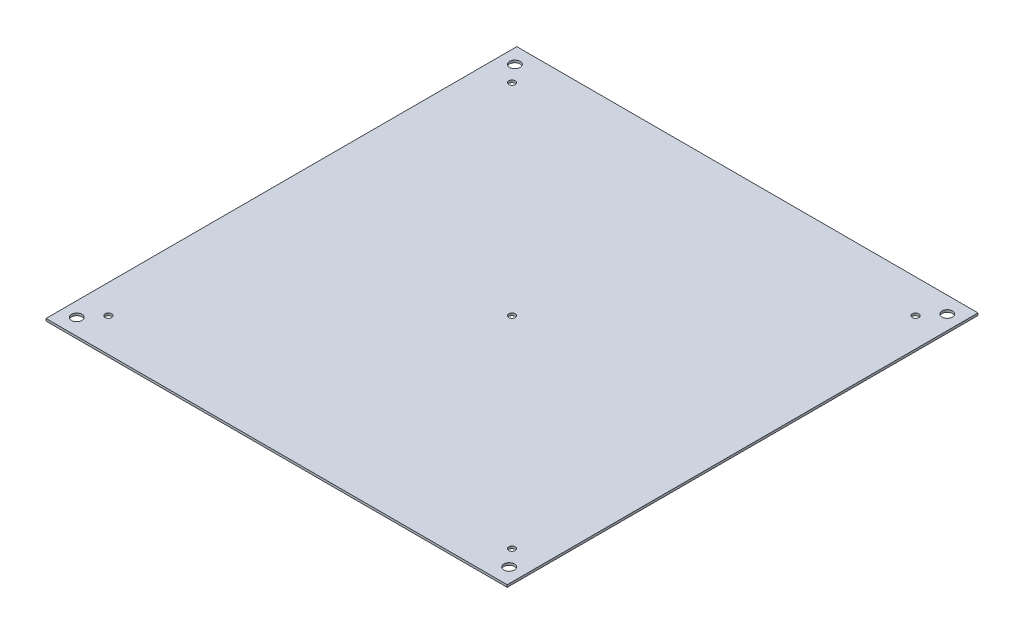
ISO-10303-21;
HEADER;
FILE_DESCRIPTION(('STEP AP214'),'2;1');
FILE_NAME('part.step','',(''),(''),'','','');
FILE_SCHEMA(('AUTOMOTIVE_DESIGN { 1 0 10303 214 1 1 1 1 }'));
ENDSEC;
DATA;
#1=APPLICATION_CONTEXT('core data for automotive mechanical design processes');
#2=APPLICATION_PROTOCOL_DEFINITION('international standard','automotive_design',2000,#1);
#3=PRODUCT_CONTEXT('',#1,'mechanical');
#4=PRODUCT('Part','Part','',(#3));
#5=PRODUCT_RELATED_PRODUCT_CATEGORY('part','',(#4));
#6=PRODUCT_DEFINITION_FORMATION('','',#4);
#7=PRODUCT_DEFINITION_CONTEXT('part definition',#1,'design');
#8=PRODUCT_DEFINITION('design','',#6,#7);
#9=PRODUCT_DEFINITION_SHAPE('','',#8);
#10=(LENGTH_UNIT() NAMED_UNIT(*) SI_UNIT(.MILLI.,.METRE.));
#11=(NAMED_UNIT(*) PLANE_ANGLE_UNIT() SI_UNIT($,.RADIAN.));
#12=(NAMED_UNIT(*) SI_UNIT($,.STERADIAN.) SOLID_ANGLE_UNIT());
#13=UNCERTAINTY_MEASURE_WITH_UNIT(LENGTH_MEASURE(1.E-05),#10,'distance_accuracy_value','');
#14=(GEOMETRIC_REPRESENTATION_CONTEXT(3) GLOBAL_UNCERTAINTY_ASSIGNED_CONTEXT((#13)) GLOBAL_UNIT_ASSIGNED_CONTEXT((#10,
#11,#12)) REPRESENTATION_CONTEXT('',''));
#15=CARTESIAN_POINT('',(0.,0.,0.));
#16=DIRECTION('',(0.,0.,1.));
#17=DIRECTION('',(1.,0.,0.));
#18=AXIS2_PLACEMENT_3D('',#15,#16,#17);
#19=CARTESIAN_POINT('',(-120.,1.2,-122.5));
#20=DIRECTION('',(1.,0.,0.));
#21=DIRECTION('',(0.,0.,-1.));
#22=AXIS2_PLACEMENT_3D('',#19,#20,#21);
#23=PLANE('',#22);
#24=DIRECTION('',(0.,0.,1.));
#25=VECTOR('',#24,1.);
#26=CARTESIAN_POINT('',(-120.,0.,-122.5));
#27=LINE('',#26,#25);
#28=CARTESIAN_POINT('',(-120.,0.,-122.5));
#29=VERTEX_POINT('',#28);
#30=CARTESIAN_POINT('',(-120.,0.,122.5));
#31=VERTEX_POINT('',#30);
#32=EDGE_CURVE('E116',#29,#31,#27,.T.);
#33=ORIENTED_EDGE('',*,*,#32,.T.);
#34=DIRECTION('',(0.,-1.,0.));
#35=VECTOR('',#34,1.);
#36=CARTESIAN_POINT('',(-120.,1.2,122.5));
#37=LINE('',#36,#35);
#38=CARTESIAN_POINT('',(-120.,1.2,122.5));
#39=VERTEX_POINT('',#38);
#40=EDGE_CURVE('E11',#39,#31,#37,.T.);
#41=ORIENTED_EDGE('',*,*,#40,.F.);
#42=DIRECTION('',(0.,0.,1.));
#43=VECTOR('',#42,1.);
#44=CARTESIAN_POINT('',(-120.,1.2,-122.5));
#45=LINE('',#44,#43);
#46=CARTESIAN_POINT('',(-120.,1.2,-122.5));
#47=VERTEX_POINT('',#46);
#48=EDGE_CURVE('E99',#47,#39,#45,.T.);
#49=ORIENTED_EDGE('',*,*,#48,.F.);
#50=DIRECTION('',(0.,-1.,0.));
#51=VECTOR('',#50,1.);
#52=CARTESIAN_POINT('',(-120.,1.2,-122.5));
#53=LINE('',#52,#51);
#54=EDGE_CURVE('E112',#47,#29,#53,.T.);
#55=ORIENTED_EDGE('',*,*,#54,.T.);
#56=EDGE_LOOP('',(#33,#41,#49,#55));
#57=FACE_BOUND('',#56,.T.);
#58=ADVANCED_FACE('F41',(#57),#23,.F.);
#59=CARTESIAN_POINT('',(120.,1.2,122.5));
#60=DIRECTION('',(0.,0.,-1.));
#61=DIRECTION('',(-1.,0.,0.));
#62=AXIS2_PLACEMENT_3D('',#59,#60,#61);
#63=PLANE('',#62);
#64=DIRECTION('',(1.,0.,0.));
#65=VECTOR('',#64,1.);
#66=CARTESIAN_POINT('',(120.,0.,122.5));
#67=LINE('',#66,#65);
#68=CARTESIAN_POINT('',(120.,0.,122.5));
#69=VERTEX_POINT('',#68);
#70=EDGE_CURVE('E104',#31,#69,#67,.T.);
#71=ORIENTED_EDGE('',*,*,#70,.T.);
#72=DIRECTION('',(0.,-1.,0.));
#73=VECTOR('',#72,1.);
#74=CARTESIAN_POINT('',(120.,1.2,122.5));
#75=LINE('',#74,#73);
#76=CARTESIAN_POINT('',(120.,1.2,122.5));
#77=VERTEX_POINT('',#76);
#78=EDGE_CURVE('E50',#77,#69,#75,.T.);
#79=ORIENTED_EDGE('',*,*,#78,.F.);
#80=DIRECTION('',(1.,0.,0.));
#81=VECTOR('',#80,1.);
#82=CARTESIAN_POINT('',(120.,1.2,122.5));
#83=LINE('',#82,#81);
#84=EDGE_CURVE('E94',#39,#77,#83,.T.);
#85=ORIENTED_EDGE('',*,*,#84,.F.);
#86=ORIENTED_EDGE('',*,*,#40,.T.);
#87=EDGE_LOOP('',(#71,#79,#85,#86));
#88=FACE_BOUND('',#87,.T.);
#89=ADVANCED_FACE('F103',(#88),#63,.F.);
#90=CARTESIAN_POINT('',(120.,1.2,-122.5));
#91=DIRECTION('',(-1.,0.,0.));
#92=DIRECTION('',(0.,0.,1.));
#93=AXIS2_PLACEMENT_3D('',#90,#91,#92);
#94=PLANE('',#93);
#95=DIRECTION('',(0.,0.,-1.));
#96=VECTOR('',#95,1.);
#97=CARTESIAN_POINT('',(120.,0.,-122.5));
#98=LINE('',#97,#96);
#99=CARTESIAN_POINT('',(120.,0.,-122.5));
#100=VERTEX_POINT('',#99);
#101=EDGE_CURVE('E80',#69,#100,#98,.T.);
#102=ORIENTED_EDGE('',*,*,#101,.T.);
#103=DIRECTION('',(0.,-1.,0.));
#104=VECTOR('',#103,1.);
#105=CARTESIAN_POINT('',(120.,1.2,-122.5));
#106=LINE('',#105,#104);
#107=CARTESIAN_POINT('',(120.,1.2,-122.5));
#108=VERTEX_POINT('',#107);
#109=EDGE_CURVE('E105',#108,#100,#106,.T.);
#110=ORIENTED_EDGE('',*,*,#109,.F.);
#111=DIRECTION('',(0.,0.,-1.));
#112=VECTOR('',#111,1.);
#113=CARTESIAN_POINT('',(120.,1.2,-122.5));
#114=LINE('',#113,#112);
#115=EDGE_CURVE('E97',#77,#108,#114,.T.);
#116=ORIENTED_EDGE('',*,*,#115,.F.);
#117=ORIENTED_EDGE('',*,*,#78,.T.);
#118=EDGE_LOOP('',(#102,#110,#116,#117));
#119=FACE_BOUND('',#118,.T.);
#120=ADVANCED_FACE('F106',(#119),#94,.F.);
#121=CARTESIAN_POINT('',(120.,1.2,-122.5));
#122=DIRECTION('',(0.,0.,1.));
#123=DIRECTION('',(1.,0.,0.));
#124=AXIS2_PLACEMENT_3D('',#121,#122,#123);
#125=PLANE('',#124);
#126=DIRECTION('',(-1.,0.,0.));
#127=VECTOR('',#126,1.);
#128=CARTESIAN_POINT('',(120.,0.,-122.5));
#129=LINE('',#128,#127);
#130=EDGE_CURVE('E86',#100,#29,#129,.T.);
#131=ORIENTED_EDGE('',*,*,#130,.T.);
#132=ORIENTED_EDGE('',*,*,#54,.F.);
#133=DIRECTION('',(-1.,0.,0.));
#134=VECTOR('',#133,1.);
#135=CARTESIAN_POINT('',(120.,1.2,-122.5));
#136=LINE('',#135,#134);
#137=EDGE_CURVE('E61',#108,#47,#136,.T.);
#138=ORIENTED_EDGE('',*,*,#137,.F.);
#139=ORIENTED_EDGE('',*,*,#109,.T.);
#140=EDGE_LOOP('',(#131,#132,#138,#139));
#141=FACE_BOUND('',#140,.T.);
#142=ADVANCED_FACE('F130',(#141),#125,.F.);
#143=CARTESIAN_POINT('',(0.,1.2,0.));
#144=DIRECTION('',(0.,-1.,0.));
#145=DIRECTION('',(0.,0.,-1.));
#146=AXIS2_PLACEMENT_3D('',#143,#144,#145);
#147=PLANE('',#146);
#148=CARTESIAN_POINT('',(112.5,1.2,114.));
#149=DIRECTION('',(0.,-1.,0.));
#150=DIRECTION('',(0.,0.,-1.));
#151=AXIS2_PLACEMENT_3D('',#148,#149,#150);
#152=CIRCLE('',#151,2.75);
#153=CARTESIAN_POINT('',(112.5,1.2,111.25));
#154=VERTEX_POINT('',#153);
#155=EDGE_CURVE('E198',#154,#154,#152,.T.);
#156=ORIENTED_EDGE('',*,*,#155,.T.);
#157=EDGE_LOOP('',(#156));
#158=FACE_BOUND('',#157,.T.);
#159=CARTESIAN_POINT('',(-112.5,1.2,-114.));
#160=DIRECTION('',(0.,-1.,0.));
#161=DIRECTION('',(0.,0.,-1.));
#162=AXIS2_PLACEMENT_3D('',#159,#160,#161);
#163=CIRCLE('',#162,2.75);
#164=CARTESIAN_POINT('',(-112.5,1.2,-116.75));
#165=VERTEX_POINT('',#164);
#166=EDGE_CURVE('E190',#165,#165,#163,.T.);
#167=ORIENTED_EDGE('',*,*,#166,.T.);
#168=EDGE_LOOP('',(#167));
#169=FACE_BOUND('',#168,.T.);
#170=CARTESIAN_POINT('',(-112.5,1.2,114.));
#171=DIRECTION('',(0.,-1.,0.));
#172=DIRECTION('',(0.,0.,-1.));
#173=AXIS2_PLACEMENT_3D('',#170,#171,#172);
#174=CIRCLE('',#173,2.75);
#175=CARTESIAN_POINT('',(-112.5,1.2,111.25));
#176=VERTEX_POINT('',#175);
#177=EDGE_CURVE('E183',#176,#176,#174,.T.);
#178=ORIENTED_EDGE('',*,*,#177,.T.);
#179=EDGE_LOOP('',(#178));
#180=FACE_BOUND('',#179,.T.);
#181=CARTESIAN_POINT('',(112.5,1.2,-114.));
#182=DIRECTION('',(0.,-1.,0.));
#183=DIRECTION('',(0.,0.,-1.));
#184=AXIS2_PLACEMENT_3D('',#181,#182,#183);
#185=CIRCLE('',#184,2.75);
#186=CARTESIAN_POINT('',(112.5,1.2,-116.75));
#187=VERTEX_POINT('',#186);
#188=EDGE_CURVE('E176',#187,#187,#185,.T.);
#189=ORIENTED_EDGE('',*,*,#188,.T.);
#190=EDGE_LOOP('',(#189));
#191=FACE_BOUND('',#190,.T.);
#192=CARTESIAN_POINT('',(0.,1.2,0.));
#193=DIRECTION('',(0.,1.,0.));
#194=DIRECTION('',(0.,0.,1.));
#195=AXIS2_PLACEMENT_3D('',#192,#193,#194);
#196=CIRCLE('',#195,1.7);
#197=CARTESIAN_POINT('',(0.,1.2,1.7));
#198=VERTEX_POINT('',#197);
#199=EDGE_CURVE('E172',#198,#198,#196,.T.);
#200=ORIENTED_EDGE('',*,*,#199,.F.);
#201=EDGE_LOOP('',(#200));
#202=FACE_BOUND('',#201,.T.);
#203=CARTESIAN_POINT('',(105.,1.2,-105.));
#204=DIRECTION('',(0.,1.,0.));
#205=DIRECTION('',(0.,0.,1.));
#206=AXIS2_PLACEMENT_3D('',#203,#204,#205);
#207=CIRCLE('',#206,1.69999999999999);
#208=CARTESIAN_POINT('',(105.,1.2,-103.3));
#209=VERTEX_POINT('',#208);
#210=EDGE_CURVE('E164',#209,#209,#207,.T.);
#211=ORIENTED_EDGE('',*,*,#210,.F.);
#212=EDGE_LOOP('',(#211));
#213=FACE_BOUND('',#212,.T.);
#214=CARTESIAN_POINT('',(-105.,1.2,105.));
#215=DIRECTION('',(0.,1.,0.));
#216=DIRECTION('',(0.,0.,1.));
#217=AXIS2_PLACEMENT_3D('',#214,#215,#216);
#218=CIRCLE('',#217,1.69999999999999);
#219=CARTESIAN_POINT('',(-105.,1.2,106.7));
#220=VERTEX_POINT('',#219);
#221=EDGE_CURVE('E156',#220,#220,#218,.T.);
#222=ORIENTED_EDGE('',*,*,#221,.F.);
#223=EDGE_LOOP('',(#222));
#224=FACE_BOUND('',#223,.T.);
#225=CARTESIAN_POINT('',(-105.,1.2,-105.));
#226=DIRECTION('',(0.,1.,0.));
#227=DIRECTION('',(0.,0.,1.));
#228=AXIS2_PLACEMENT_3D('',#225,#226,#227);
#229=CIRCLE('',#228,1.69999999999999);
#230=CARTESIAN_POINT('',(-105.,1.2,-103.3));
#231=VERTEX_POINT('',#230);
#232=EDGE_CURVE('E148',#231,#231,#229,.T.);
#233=ORIENTED_EDGE('',*,*,#232,.F.);
#234=EDGE_LOOP('',(#233));
#235=FACE_BOUND('',#234,.T.);
#236=CARTESIAN_POINT('',(105.,1.2,105.));
#237=DIRECTION('',(0.,1.,0.));
#238=DIRECTION('',(0.,0.,1.));
#239=AXIS2_PLACEMENT_3D('',#236,#237,#238);
#240=CIRCLE('',#239,1.69999999999999);
#241=CARTESIAN_POINT('',(105.,1.2,106.7));
#242=VERTEX_POINT('',#241);
#243=EDGE_CURVE('E140',#242,#242,#240,.T.);
#244=ORIENTED_EDGE('',*,*,#243,.F.);
#245=EDGE_LOOP('',(#244));
#246=FACE_BOUND('',#245,.T.);
#247=ORIENTED_EDGE('',*,*,#48,.T.);
#248=ORIENTED_EDGE('',*,*,#84,.T.);
#249=ORIENTED_EDGE('',*,*,#115,.T.);
#250=ORIENTED_EDGE('',*,*,#137,.T.);
#251=EDGE_LOOP('',(#247,#248,#249,#250));
#252=FACE_BOUND('',#251,.T.);
#253=ADVANCED_FACE('F95',(#158,#169,#180,#191,#202,#213,#224,#235,#246,#252),#147,.F.);
#254=CARTESIAN_POINT('',(0.,0.,0.));
#255=DIRECTION('',(0.,-1.,0.));
#256=DIRECTION('',(0.,0.,-1.));
#257=AXIS2_PLACEMENT_3D('',#254,#255,#256);
#258=PLANE('',#257);
#259=CARTESIAN_POINT('',(112.5,0.,114.));
#260=DIRECTION('',(0.,-1.,0.));
#261=DIRECTION('',(0.,0.,-1.));
#262=AXIS2_PLACEMENT_3D('',#259,#260,#261);
#263=CIRCLE('',#262,2.75);
#264=CARTESIAN_POINT('',(112.5,0.,111.25));
#265=VERTEX_POINT('',#264);
#266=EDGE_CURVE('E202',#265,#265,#263,.T.);
#267=ORIENTED_EDGE('',*,*,#266,.F.);
#268=EDGE_LOOP('',(#267));
#269=FACE_BOUND('',#268,.T.);
#270=CARTESIAN_POINT('',(-112.5,0.,-114.));
#271=DIRECTION('',(0.,-1.,0.));
#272=DIRECTION('',(0.,0.,-1.));
#273=AXIS2_PLACEMENT_3D('',#270,#271,#272);
#274=CIRCLE('',#273,2.75);
#275=CARTESIAN_POINT('',(-112.5,0.,-116.75));
#276=VERTEX_POINT('',#275);
#277=EDGE_CURVE('E194',#276,#276,#274,.T.);
#278=ORIENTED_EDGE('',*,*,#277,.F.);
#279=EDGE_LOOP('',(#278));
#280=FACE_BOUND('',#279,.T.);
#281=CARTESIAN_POINT('',(-112.5,0.,114.));
#282=DIRECTION('',(0.,-1.,0.));
#283=DIRECTION('',(0.,0.,-1.));
#284=AXIS2_PLACEMENT_3D('',#281,#282,#283);
#285=CIRCLE('',#284,2.75);
#286=CARTESIAN_POINT('',(-112.5,0.,111.25));
#287=VERTEX_POINT('',#286);
#288=EDGE_CURVE('E186',#287,#287,#285,.T.);
#289=ORIENTED_EDGE('',*,*,#288,.F.);
#290=EDGE_LOOP('',(#289));
#291=FACE_BOUND('',#290,.T.);
#292=CARTESIAN_POINT('',(112.5,0.,-114.));
#293=DIRECTION('',(0.,-1.,0.));
#294=DIRECTION('',(0.,0.,-1.));
#295=AXIS2_PLACEMENT_3D('',#292,#293,#294);
#296=CIRCLE('',#295,2.75);
#297=CARTESIAN_POINT('',(112.5,0.,-116.75));
#298=VERTEX_POINT('',#297);
#299=EDGE_CURVE('E180',#298,#298,#296,.T.);
#300=ORIENTED_EDGE('',*,*,#299,.F.);
#301=EDGE_LOOP('',(#300));
#302=FACE_BOUND('',#301,.T.);
#303=CARTESIAN_POINT('',(0.,0.,0.));
#304=DIRECTION('',(0.,1.,0.));
#305=DIRECTION('',(0.,0.,1.));
#306=AXIS2_PLACEMENT_3D('',#303,#304,#305);
#307=CIRCLE('',#306,1.7);
#308=CARTESIAN_POINT('',(0.,0.,1.7));
#309=VERTEX_POINT('',#308);
#310=EDGE_CURVE('E168',#309,#309,#307,.T.);
#311=ORIENTED_EDGE('',*,*,#310,.T.);
#312=EDGE_LOOP('',(#311));
#313=FACE_BOUND('',#312,.T.);
#314=CARTESIAN_POINT('',(105.,0.,-105.));
#315=DIRECTION('',(0.,1.,0.));
#316=DIRECTION('',(0.,0.,1.));
#317=AXIS2_PLACEMENT_3D('',#314,#315,#316);
#318=CIRCLE('',#317,1.69999999999999);
#319=CARTESIAN_POINT('',(105.,0.,-103.3));
#320=VERTEX_POINT('',#319);
#321=EDGE_CURVE('E160',#320,#320,#318,.T.);
#322=ORIENTED_EDGE('',*,*,#321,.T.);
#323=EDGE_LOOP('',(#322));
#324=FACE_BOUND('',#323,.T.);
#325=CARTESIAN_POINT('',(-105.,0.,105.));
#326=DIRECTION('',(0.,1.,0.));
#327=DIRECTION('',(0.,0.,1.));
#328=AXIS2_PLACEMENT_3D('',#325,#326,#327);
#329=CIRCLE('',#328,1.69999999999999);
#330=CARTESIAN_POINT('',(-105.,0.,106.7));
#331=VERTEX_POINT('',#330);
#332=EDGE_CURVE('E152',#331,#331,#329,.T.);
#333=ORIENTED_EDGE('',*,*,#332,.T.);
#334=EDGE_LOOP('',(#333));
#335=FACE_BOUND('',#334,.T.);
#336=CARTESIAN_POINT('',(-105.,0.,-105.));
#337=DIRECTION('',(0.,1.,0.));
#338=DIRECTION('',(0.,0.,1.));
#339=AXIS2_PLACEMENT_3D('',#336,#337,#338);
#340=CIRCLE('',#339,1.69999999999999);
#341=CARTESIAN_POINT('',(-105.,0.,-103.3));
#342=VERTEX_POINT('',#341);
#343=EDGE_CURVE('E144',#342,#342,#340,.T.);
#344=ORIENTED_EDGE('',*,*,#343,.T.);
#345=EDGE_LOOP('',(#344));
#346=FACE_BOUND('',#345,.T.);
#347=CARTESIAN_POINT('',(105.,0.,105.));
#348=DIRECTION('',(0.,1.,0.));
#349=DIRECTION('',(0.,0.,1.));
#350=AXIS2_PLACEMENT_3D('',#347,#348,#349);
#351=CIRCLE('',#350,1.69999999999999);
#352=CARTESIAN_POINT('',(105.,0.,106.7));
#353=VERTEX_POINT('',#352);
#354=EDGE_CURVE('E120',#353,#353,#351,.T.);
#355=ORIENTED_EDGE('',*,*,#354,.T.);
#356=EDGE_LOOP('',(#355));
#357=FACE_BOUND('',#356,.T.);
#358=ORIENTED_EDGE('',*,*,#32,.F.);
#359=ORIENTED_EDGE('',*,*,#130,.F.);
#360=ORIENTED_EDGE('',*,*,#101,.F.);
#361=ORIENTED_EDGE('',*,*,#70,.F.);
#362=EDGE_LOOP('',(#358,#359,#360,#361));
#363=FACE_BOUND('',#362,.T.);
#364=ADVANCED_FACE('F133',(#269,#280,#291,#302,#313,#324,#335,#346,#357,#363),#258,.T.);
#365=CARTESIAN_POINT('',(105.,1.2,105.));
#366=DIRECTION('',(0.,1.,0.));
#367=DIRECTION('',(0.,0.,1.));
#368=AXIS2_PLACEMENT_3D('',#365,#366,#367);
#369=CYLINDRICAL_SURFACE('',#368,1.69999999999999);
#370=ORIENTED_EDGE('',*,*,#354,.F.);
#371=EDGE_LOOP('',(#370));
#372=FACE_BOUND('',#371,.T.);
#373=ORIENTED_EDGE('',*,*,#243,.T.);
#374=EDGE_LOOP('',(#373));
#375=FACE_BOUND('',#374,.T.);
#376=ADVANCED_FACE('F211',(#372,#375),#369,.F.);
#377=CARTESIAN_POINT('',(-105.,1.2,-105.));
#378=DIRECTION('',(0.,1.,0.));
#379=DIRECTION('',(0.,0.,1.));
#380=AXIS2_PLACEMENT_3D('',#377,#378,#379);
#381=CYLINDRICAL_SURFACE('',#380,1.69999999999999);
#382=ORIENTED_EDGE('',*,*,#343,.F.);
#383=EDGE_LOOP('',(#382));
#384=FACE_BOUND('',#383,.T.);
#385=ORIENTED_EDGE('',*,*,#232,.T.);
#386=EDGE_LOOP('',(#385));
#387=FACE_BOUND('',#386,.T.);
#388=ADVANCED_FACE('F231',(#384,#387),#381,.F.);
#389=CARTESIAN_POINT('',(-105.,1.2,105.));
#390=DIRECTION('',(0.,1.,0.));
#391=DIRECTION('',(0.,0.,1.));
#392=AXIS2_PLACEMENT_3D('',#389,#390,#391);
#393=CYLINDRICAL_SURFACE('',#392,1.69999999999999);
#394=ORIENTED_EDGE('',*,*,#332,.F.);
#395=EDGE_LOOP('',(#394));
#396=FACE_BOUND('',#395,.T.);
#397=ORIENTED_EDGE('',*,*,#221,.T.);
#398=EDGE_LOOP('',(#397));
#399=FACE_BOUND('',#398,.T.);
#400=ADVANCED_FACE('F282',(#396,#399),#393,.F.);
#401=CARTESIAN_POINT('',(105.,1.2,-105.));
#402=DIRECTION('',(0.,1.,0.));
#403=DIRECTION('',(0.,0.,1.));
#404=AXIS2_PLACEMENT_3D('',#401,#402,#403);
#405=CYLINDRICAL_SURFACE('',#404,1.69999999999999);
#406=ORIENTED_EDGE('',*,*,#321,.F.);
#407=EDGE_LOOP('',(#406));
#408=FACE_BOUND('',#407,.T.);
#409=ORIENTED_EDGE('',*,*,#210,.T.);
#410=EDGE_LOOP('',(#409));
#411=FACE_BOUND('',#410,.T.);
#412=ADVANCED_FACE('F290',(#408,#411),#405,.F.);
#413=CARTESIAN_POINT('',(0.,1.2,0.));
#414=DIRECTION('',(0.,1.,0.));
#415=DIRECTION('',(0.,0.,1.));
#416=AXIS2_PLACEMENT_3D('',#413,#414,#415);
#417=CYLINDRICAL_SURFACE('',#416,1.7);
#418=ORIENTED_EDGE('',*,*,#310,.F.);
#419=EDGE_LOOP('',(#418));
#420=FACE_BOUND('',#419,.T.);
#421=ORIENTED_EDGE('',*,*,#199,.T.);
#422=EDGE_LOOP('',(#421));
#423=FACE_BOUND('',#422,.T.);
#424=ADVANCED_FACE('F298',(#420,#423),#417,.F.);
#425=CARTESIAN_POINT('',(112.5,0.,-114.));
#426=DIRECTION('',(0.,-1.,0.));
#427=DIRECTION('',(0.,0.,-1.));
#428=AXIS2_PLACEMENT_3D('',#425,#426,#427);
#429=CYLINDRICAL_SURFACE('',#428,2.75);
#430=ORIENTED_EDGE('',*,*,#188,.F.);
#431=EDGE_LOOP('',(#430));
#432=FACE_BOUND('',#431,.T.);
#433=ORIENTED_EDGE('',*,*,#299,.T.);
#434=EDGE_LOOP('',(#433));
#435=FACE_BOUND('',#434,.T.);
#436=ADVANCED_FACE('F305',(#432,#435),#429,.F.);
#437=CARTESIAN_POINT('',(-112.5,0.,114.));
#438=DIRECTION('',(0.,-1.,0.));
#439=DIRECTION('',(0.,0.,-1.));
#440=AXIS2_PLACEMENT_3D('',#437,#438,#439);
#441=CYLINDRICAL_SURFACE('',#440,2.75);
#442=ORIENTED_EDGE('',*,*,#177,.F.);
#443=EDGE_LOOP('',(#442));
#444=FACE_BOUND('',#443,.T.);
#445=ORIENTED_EDGE('',*,*,#288,.T.);
#446=EDGE_LOOP('',(#445));
#447=FACE_BOUND('',#446,.T.);
#448=ADVANCED_FACE('F312',(#444,#447),#441,.F.);
#449=CARTESIAN_POINT('',(-112.5,0.,-114.));
#450=DIRECTION('',(0.,-1.,0.));
#451=DIRECTION('',(0.,0.,-1.));
#452=AXIS2_PLACEMENT_3D('',#449,#450,#451);
#453=CYLINDRICAL_SURFACE('',#452,2.75);
#454=ORIENTED_EDGE('',*,*,#166,.F.);
#455=EDGE_LOOP('',(#454));
#456=FACE_BOUND('',#455,.T.);
#457=ORIENTED_EDGE('',*,*,#277,.T.);
#458=EDGE_LOOP('',(#457));
#459=FACE_BOUND('',#458,.T.);
#460=ADVANCED_FACE('F320',(#456,#459),#453,.F.);
#461=CARTESIAN_POINT('',(112.5,0.,114.));
#462=DIRECTION('',(0.,-1.,0.));
#463=DIRECTION('',(0.,0.,-1.));
#464=AXIS2_PLACEMENT_3D('',#461,#462,#463);
#465=CYLINDRICAL_SURFACE('',#464,2.75);
#466=ORIENTED_EDGE('',*,*,#155,.F.);
#467=EDGE_LOOP('',(#466));
#468=FACE_BOUND('',#467,.T.);
#469=ORIENTED_EDGE('',*,*,#266,.T.);
#470=EDGE_LOOP('',(#469));
#471=FACE_BOUND('',#470,.T.);
#472=ADVANCED_FACE('F207',(#468,#471),#465,.F.);
#473=CLOSED_SHELL('',(#58,#89,#120,#142,#253,#364,#376,#388,#400,#412,#424,#436,#448,#460,#472));
#474=MANIFOLD_SOLID_BREP('B2',#473);
#475=ADVANCED_BREP_SHAPE_REPRESENTATION('',(#18,#474),#14);
#476=SHAPE_DEFINITION_REPRESENTATION(#9,#475);
ENDSEC;
END-ISO-10303-21;
